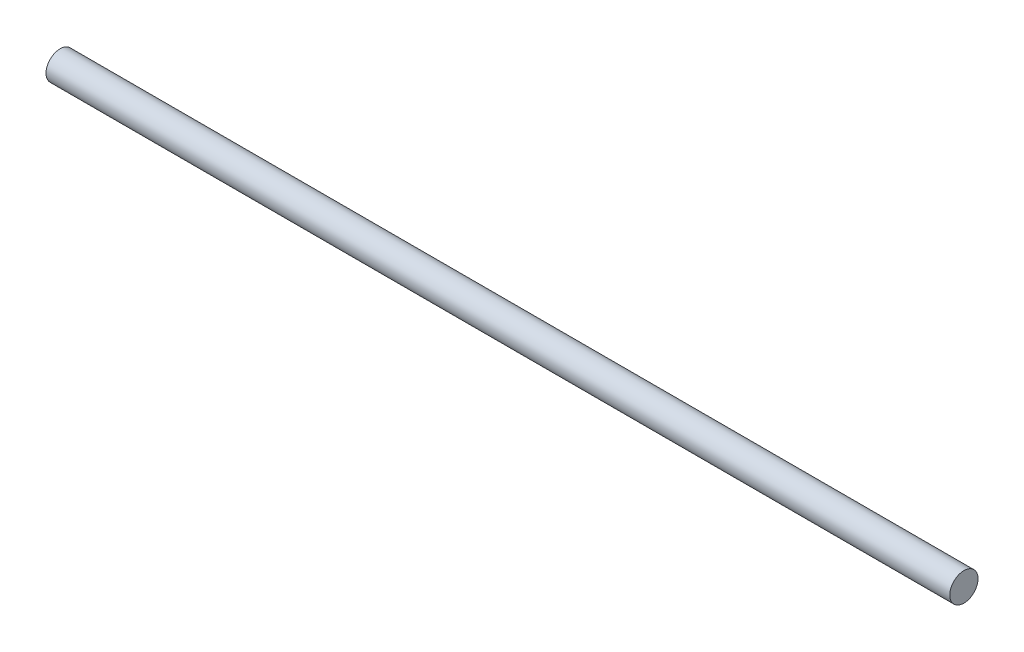
ISO-10303-21;
HEADER;
FILE_DESCRIPTION(('STEP AP214'),'2;1');
FILE_NAME('part.step','',(''),(''),'','','');
FILE_SCHEMA(('AUTOMOTIVE_DESIGN { 1 0 10303 214 1 1 1 1 }'));
ENDSEC;
DATA;
#1=APPLICATION_CONTEXT('core data for automotive mechanical design processes');
#2=APPLICATION_PROTOCOL_DEFINITION('international standard','automotive_design',2000,#1);
#3=PRODUCT_CONTEXT('',#1,'mechanical');
#4=PRODUCT('Part','Part','',(#3));
#5=PRODUCT_RELATED_PRODUCT_CATEGORY('part','',(#4));
#6=PRODUCT_DEFINITION_FORMATION('','',#4);
#7=PRODUCT_DEFINITION_CONTEXT('part definition',#1,'design');
#8=PRODUCT_DEFINITION('design','',#6,#7);
#9=PRODUCT_DEFINITION_SHAPE('','',#8);
#10=(LENGTH_UNIT() NAMED_UNIT(*) SI_UNIT(.MILLI.,.METRE.));
#11=(NAMED_UNIT(*) PLANE_ANGLE_UNIT() SI_UNIT($,.RADIAN.));
#12=(NAMED_UNIT(*) SI_UNIT($,.STERADIAN.) SOLID_ANGLE_UNIT());
#13=UNCERTAINTY_MEASURE_WITH_UNIT(LENGTH_MEASURE(1.E-05),#10,'distance_accuracy_value','');
#14=(GEOMETRIC_REPRESENTATION_CONTEXT(3) GLOBAL_UNCERTAINTY_ASSIGNED_CONTEXT((#13)) GLOBAL_UNIT_ASSIGNED_CONTEXT((#10,
#11,#12)) REPRESENTATION_CONTEXT('',''));
#15=CARTESIAN_POINT('',(0.,0.,0.));
#16=DIRECTION('',(0.,0.,1.));
#17=DIRECTION('',(1.,0.,0.));
#18=AXIS2_PLACEMENT_3D('',#15,#16,#17);
#19=CARTESIAN_POINT('',(0.,0.,0.));
#20=DIRECTION('',(-1.,0.,0.));
#21=DIRECTION('',(0.,0.,1.));
#22=AXIS2_PLACEMENT_3D('',#19,#20,#21);
#23=PLANE('',#22);
#24=CARTESIAN_POINT('',(0.,0.,0.));
#25=DIRECTION('',(-1.,0.,0.));
#26=DIRECTION('',(0.,0.,1.));
#27=AXIS2_PLACEMENT_3D('',#24,#25,#26);
#28=CIRCLE('',#27,9.525);
#29=CARTESIAN_POINT('',(0.,0.,9.525));
#30=VERTEX_POINT('',#29);
#31=EDGE_CURVE('E47',#30,#30,#28,.T.);
#32=ORIENTED_EDGE('',*,*,#31,.F.);
#33=EDGE_LOOP('',(#32));
#34=FACE_BOUND('',#33,.T.);
#35=ADVANCED_FACE('F40',(#34),#23,.F.);
#36=CARTESIAN_POINT('',(-609.6,0.,0.));
#37=DIRECTION('',(-1.,0.,0.));
#38=DIRECTION('',(0.,0.,1.));
#39=AXIS2_PLACEMENT_3D('',#36,#37,#38);
#40=PLANE('',#39);
#41=CARTESIAN_POINT('',(-609.6,0.,0.));
#42=DIRECTION('',(-1.,0.,0.));
#43=DIRECTION('',(0.,0.,1.));
#44=AXIS2_PLACEMENT_3D('',#41,#42,#43);
#45=CIRCLE('',#44,9.525);
#46=CARTESIAN_POINT('',(-609.6,0.,9.52500000000007));
#47=VERTEX_POINT('',#46);
#48=EDGE_CURVE('E12',#47,#47,#45,.T.);
#49=ORIENTED_EDGE('',*,*,#48,.T.);
#50=EDGE_LOOP('',(#49));
#51=FACE_BOUND('',#50,.T.);
#52=ADVANCED_FACE('F54',(#51),#40,.T.);
#53=CARTESIAN_POINT('',(0.,0.,0.));
#54=DIRECTION('',(-1.,0.,0.));
#55=DIRECTION('',(0.,0.,1.));
#56=AXIS2_PLACEMENT_3D('',#53,#54,#55);
#57=CYLINDRICAL_SURFACE('',#56,9.525);
#58=ORIENTED_EDGE('',*,*,#48,.F.);
#59=EDGE_LOOP('',(#58));
#60=FACE_BOUND('',#59,.T.);
#61=ORIENTED_EDGE('',*,*,#31,.T.);
#62=EDGE_LOOP('',(#61));
#63=FACE_BOUND('',#62,.T.);
#64=ADVANCED_FACE('F56',(#60,#63),#57,.T.);
#65=CLOSED_SHELL('',(#35,#52,#64));
#66=MANIFOLD_SOLID_BREP('B2',#65);
#67=ADVANCED_BREP_SHAPE_REPRESENTATION('',(#18,#66),#14);
#68=SHAPE_DEFINITION_REPRESENTATION(#9,#67);
ENDSEC;
END-ISO-10303-21;
